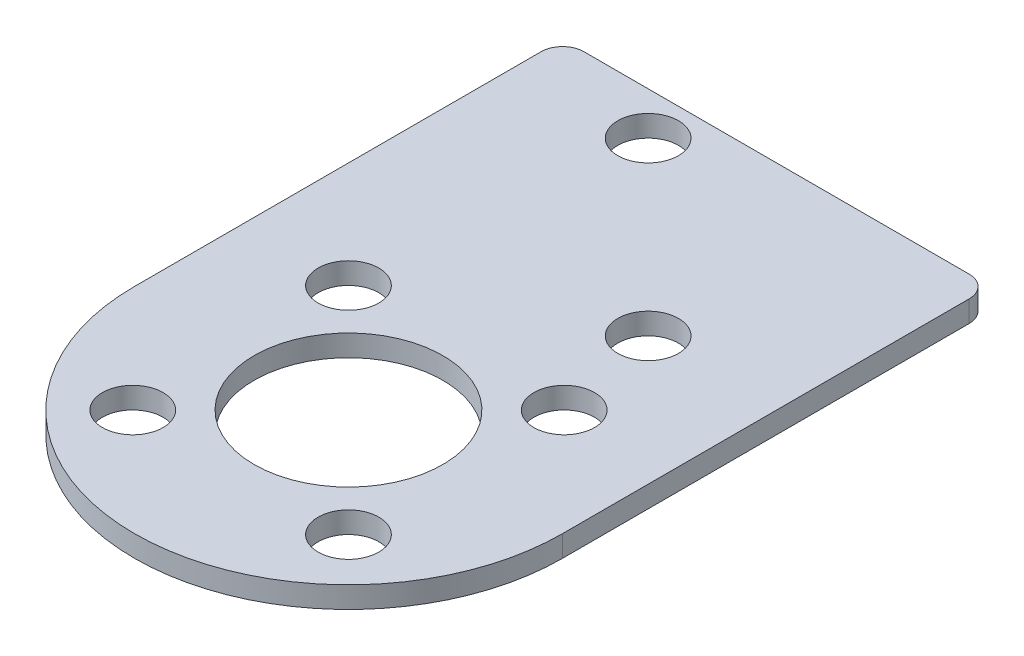
ISO-10303-21;
HEADER;
FILE_DESCRIPTION(('STEP AP214'),'2;1');
FILE_NAME('part.step','',(''),(''),'','','');
FILE_SCHEMA(('AUTOMOTIVE_DESIGN { 1 0 10303 214 1 1 1 1 }'));
ENDSEC;
DATA;
#1=APPLICATION_CONTEXT('core data for automotive mechanical design processes');
#2=APPLICATION_PROTOCOL_DEFINITION('international standard','automotive_design',2000,#1);
#3=PRODUCT_CONTEXT('',#1,'mechanical');
#4=PRODUCT('Part','Part','',(#3));
#5=PRODUCT_RELATED_PRODUCT_CATEGORY('part','',(#4));
#6=PRODUCT_DEFINITION_FORMATION('','',#4);
#7=PRODUCT_DEFINITION_CONTEXT('part definition',#1,'design');
#8=PRODUCT_DEFINITION('design','',#6,#7);
#9=PRODUCT_DEFINITION_SHAPE('','',#8);
#10=(LENGTH_UNIT() NAMED_UNIT(*) SI_UNIT(.MILLI.,.METRE.));
#11=(NAMED_UNIT(*) PLANE_ANGLE_UNIT() SI_UNIT($,.RADIAN.));
#12=(NAMED_UNIT(*) SI_UNIT($,.STERADIAN.) SOLID_ANGLE_UNIT());
#13=UNCERTAINTY_MEASURE_WITH_UNIT(LENGTH_MEASURE(1.E-05),#10,'distance_accuracy_value','');
#14=(GEOMETRIC_REPRESENTATION_CONTEXT(3) GLOBAL_UNCERTAINTY_ASSIGNED_CONTEXT((#13)) GLOBAL_UNIT_ASSIGNED_CONTEXT((#10,
#11,#12)) REPRESENTATION_CONTEXT('',''));
#15=CARTESIAN_POINT('',(0.,0.,0.));
#16=DIRECTION('',(0.,0.,1.));
#17=DIRECTION('',(1.,0.,0.));
#18=AXIS2_PLACEMENT_3D('',#15,#16,#17);
#19=CARTESIAN_POINT('',(-15.875,1.5875,0.));
#20=DIRECTION('',(-1.,0.,0.));
#21=DIRECTION('',(0.,0.,1.));
#22=AXIS2_PLACEMENT_3D('',#19,#20,#21);
#23=PLANE('',#22);
#24=DIRECTION('',(0.,0.,-1.));
#25=VECTOR('',#24,1.);
#26=CARTESIAN_POINT('',(-15.875,0.,0.));
#27=LINE('',#26,#25);
#28=CARTESIAN_POINT('',(-15.875,0.,0.));
#29=VERTEX_POINT('',#28);
#30=CARTESIAN_POINT('',(-15.875,0.,-30.1625));
#31=VERTEX_POINT('',#30);
#32=EDGE_CURVE('E145',#29,#31,#27,.T.);
#33=ORIENTED_EDGE('',*,*,#32,.F.);
#34=DIRECTION('',(0.,-1.,0.));
#35=VECTOR('',#34,1.);
#36=CARTESIAN_POINT('',(-15.875,1.5875,0.));
#37=LINE('',#36,#35);
#38=CARTESIAN_POINT('',(-15.875,1.5875,0.));
#39=VERTEX_POINT('',#38);
#40=EDGE_CURVE('E11',#39,#29,#37,.T.);
#41=ORIENTED_EDGE('',*,*,#40,.F.);
#42=DIRECTION('',(0.,0.,-1.));
#43=VECTOR('',#42,1.);
#44=CARTESIAN_POINT('',(-15.875,1.5875,0.));
#45=LINE('',#44,#43);
#46=CARTESIAN_POINT('',(-15.875,1.5875,-30.1625));
#47=VERTEX_POINT('',#46);
#48=EDGE_CURVE('E366',#39,#47,#45,.T.);
#49=ORIENTED_EDGE('',*,*,#48,.T.);
#50=DIRECTION('',(0.,-1.,0.));
#51=VECTOR('',#50,1.);
#52=CARTESIAN_POINT('',(-15.875,1.5875,-30.1625));
#53=LINE('',#52,#51);
#54=EDGE_CURVE('E58',#47,#31,#53,.T.);
#55=ORIENTED_EDGE('',*,*,#54,.T.);
#56=EDGE_LOOP('',(#33,#41,#49,#55));
#57=FACE_BOUND('',#56,.T.);
#58=ADVANCED_FACE('F41',(#57),#23,.T.);
#59=CARTESIAN_POINT('',(0.,1.5875,0.));
#60=DIRECTION('',(0.,-1.,0.));
#61=DIRECTION('',(0.,0.,-1.));
#62=AXIS2_PLACEMENT_3D('',#59,#60,#61);
#63=CYLINDRICAL_SURFACE('',#62,15.875);
#64=CARTESIAN_POINT('',(0.,0.,0.));
#65=DIRECTION('',(0.,1.,0.));
#66=DIRECTION('',(0.,0.,1.));
#67=AXIS2_PLACEMENT_3D('',#64,#65,#66);
#68=CIRCLE('',#67,15.875);
#69=CARTESIAN_POINT('',(15.875,0.,0.));
#70=VERTEX_POINT('',#69);
#71=EDGE_CURVE('E147',#29,#70,#68,.T.);
#72=ORIENTED_EDGE('',*,*,#71,.T.);
#73=DIRECTION('',(0.,-1.,0.));
#74=VECTOR('',#73,1.);
#75=CARTESIAN_POINT('',(15.875,1.5875,0.));
#76=LINE('',#75,#74);
#77=CARTESIAN_POINT('',(15.875,1.5875,0.));
#78=VERTEX_POINT('',#77);
#79=EDGE_CURVE('E50',#78,#70,#76,.T.);
#80=ORIENTED_EDGE('',*,*,#79,.F.);
#81=CARTESIAN_POINT('',(0.,1.5875,0.));
#82=DIRECTION('',(0.,1.,0.));
#83=DIRECTION('',(0.,0.,1.));
#84=AXIS2_PLACEMENT_3D('',#81,#82,#83);
#85=CIRCLE('',#84,15.875);
#86=EDGE_CURVE('E368',#39,#78,#85,.T.);
#87=ORIENTED_EDGE('',*,*,#86,.F.);
#88=ORIENTED_EDGE('',*,*,#40,.T.);
#89=EDGE_LOOP('',(#72,#80,#87,#88));
#90=FACE_BOUND('',#89,.T.);
#91=ADVANCED_FACE('F180',(#90),#63,.T.);
#92=CARTESIAN_POINT('',(15.875,1.5875,0.));
#93=DIRECTION('',(-1.,0.,0.));
#94=DIRECTION('',(0.,0.,1.));
#95=AXIS2_PLACEMENT_3D('',#92,#93,#94);
#96=PLANE('',#95);
#97=DIRECTION('',(0.,0.,-1.));
#98=VECTOR('',#97,1.);
#99=CARTESIAN_POINT('',(15.875,0.,0.));
#100=LINE('',#99,#98);
#101=CARTESIAN_POINT('',(15.875,0.,-30.1625));
#102=VERTEX_POINT('',#101);
#103=EDGE_CURVE('E150',#70,#102,#100,.T.);
#104=ORIENTED_EDGE('',*,*,#103,.T.);
#105=DIRECTION('',(0.,-1.,0.));
#106=VECTOR('',#105,1.);
#107=CARTESIAN_POINT('',(15.875,1.5875,-30.1625));
#108=LINE('',#107,#106);
#109=CARTESIAN_POINT('',(15.875,1.5875,-30.1625));
#110=VERTEX_POINT('',#109);
#111=EDGE_CURVE('E105',#110,#102,#108,.T.);
#112=ORIENTED_EDGE('',*,*,#111,.F.);
#113=DIRECTION('',(0.,0.,-1.));
#114=VECTOR('',#113,1.);
#115=CARTESIAN_POINT('',(15.875,1.5875,0.));
#116=LINE('',#115,#114);
#117=EDGE_CURVE('E115',#78,#110,#116,.T.);
#118=ORIENTED_EDGE('',*,*,#117,.F.);
#119=ORIENTED_EDGE('',*,*,#79,.T.);
#120=EDGE_LOOP('',(#104,#112,#118,#119));
#121=FACE_BOUND('',#120,.T.);
#122=ADVANCED_FACE('F177',(#121),#96,.F.);
#123=CARTESIAN_POINT('',(14.2875,1.5875,-30.1625));
#124=DIRECTION('',(0.,-1.,0.));
#125=DIRECTION('',(0.,0.,-1.));
#126=AXIS2_PLACEMENT_3D('',#123,#124,#125);
#127=CYLINDRICAL_SURFACE('',#126,1.5875);
#128=CARTESIAN_POINT('',(14.2875,0.,-30.1625));
#129=DIRECTION('',(0.,1.,0.));
#130=DIRECTION('',(0.,0.,1.));
#131=AXIS2_PLACEMENT_3D('',#128,#129,#130);
#132=CIRCLE('',#131,1.5875);
#133=CARTESIAN_POINT('',(14.2875,0.,-31.75));
#134=VERTEX_POINT('',#133);
#135=EDGE_CURVE('E101',#134,#102,#132,.F.);
#136=ORIENTED_EDGE('',*,*,#135,.F.);
#137=DIRECTION('',(0.,-1.,0.));
#138=VECTOR('',#137,1.);
#139=CARTESIAN_POINT('',(14.2875,1.5875,-31.75));
#140=LINE('',#139,#138);
#141=CARTESIAN_POINT('',(14.2875,1.5875,-31.75));
#142=VERTEX_POINT('',#141);
#143=EDGE_CURVE('E96',#142,#134,#140,.T.);
#144=ORIENTED_EDGE('',*,*,#143,.F.);
#145=CARTESIAN_POINT('',(14.2875,1.5875,-30.1625));
#146=DIRECTION('',(0.,1.,0.));
#147=DIRECTION('',(0.,0.,1.));
#148=AXIS2_PLACEMENT_3D('',#145,#146,#147);
#149=CIRCLE('',#148,1.5875);
#150=EDGE_CURVE('E99',#142,#110,#149,.F.);
#151=ORIENTED_EDGE('',*,*,#150,.T.);
#152=ORIENTED_EDGE('',*,*,#111,.T.);
#153=EDGE_LOOP('',(#136,#144,#151,#152));
#154=FACE_BOUND('',#153,.T.);
#155=ADVANCED_FACE('F98',(#154),#127,.T.);
#156=CARTESIAN_POINT('',(0.,1.5875,-31.75));
#157=DIRECTION('',(0.,0.,-1.));
#158=DIRECTION('',(-1.,0.,0.));
#159=AXIS2_PLACEMENT_3D('',#156,#157,#158);
#160=PLANE('',#159);
#161=DIRECTION('',(1.,0.,0.));
#162=VECTOR('',#161,1.);
#163=CARTESIAN_POINT('',(0.,0.,-31.75));
#164=LINE('',#163,#162);
#165=CARTESIAN_POINT('',(-14.2875,0.,-31.75));
#166=VERTEX_POINT('',#165);
#167=EDGE_CURVE('E154',#166,#134,#164,.T.);
#168=ORIENTED_EDGE('',*,*,#167,.F.);
#169=DIRECTION('',(0.,-1.,0.));
#170=VECTOR('',#169,1.);
#171=CARTESIAN_POINT('',(-14.2875,1.5875,-31.75));
#172=LINE('',#171,#170);
#173=CARTESIAN_POINT('',(-14.2875,1.5875,-31.75));
#174=VERTEX_POINT('',#173);
#175=EDGE_CURVE('E77',#174,#166,#172,.T.);
#176=ORIENTED_EDGE('',*,*,#175,.F.);
#177=DIRECTION('',(1.,0.,0.));
#178=VECTOR('',#177,1.);
#179=CARTESIAN_POINT('',(0.,1.5875,-31.75));
#180=LINE('',#179,#178);
#181=EDGE_CURVE('E113',#174,#142,#180,.T.);
#182=ORIENTED_EDGE('',*,*,#181,.T.);
#183=ORIENTED_EDGE('',*,*,#143,.T.);
#184=EDGE_LOOP('',(#168,#176,#182,#183));
#185=FACE_BOUND('',#184,.T.);
#186=ADVANCED_FACE('F118',(#185),#160,.T.);
#187=CARTESIAN_POINT('',(8.,1.5875,8.));
#188=DIRECTION('',(0.,-1.,0.));
#189=DIRECTION('',(0.,0.,-1.));
#190=AXIS2_PLACEMENT_3D('',#187,#188,#189);
#191=CYLINDRICAL_SURFACE('',#190,2.25);
#192=CARTESIAN_POINT('',(8.,1.5875,8.));
#193=DIRECTION('',(0.,1.,0.));
#194=DIRECTION('',(0.,0.,1.));
#195=AXIS2_PLACEMENT_3D('',#192,#193,#194);
#196=CIRCLE('',#195,2.25);
#197=CARTESIAN_POINT('',(8.,1.5875,10.25));
#198=VERTEX_POINT('',#197);
#199=EDGE_CURVE('E130',#198,#198,#196,.T.);
#200=ORIENTED_EDGE('',*,*,#199,.T.);
#201=EDGE_LOOP('',(#200));
#202=FACE_BOUND('',#201,.T.);
#203=CARTESIAN_POINT('',(8.,0.,8.));
#204=DIRECTION('',(0.,1.,0.));
#205=DIRECTION('',(0.,0.,1.));
#206=AXIS2_PLACEMENT_3D('',#203,#204,#205);
#207=CIRCLE('',#206,2.25);
#208=CARTESIAN_POINT('',(8.,0.,10.25));
#209=VERTEX_POINT('',#208);
#210=EDGE_CURVE('E165',#209,#209,#207,.T.);
#211=ORIENTED_EDGE('',*,*,#210,.F.);
#212=EDGE_LOOP('',(#211));
#213=FACE_BOUND('',#212,.T.);
#214=ADVANCED_FACE('F225',(#202,#213),#191,.F.);
#215=CARTESIAN_POINT('',(-8.,1.5875,-8.));
#216=DIRECTION('',(0.,-1.,0.));
#217=DIRECTION('',(0.,0.,-1.));
#218=AXIS2_PLACEMENT_3D('',#215,#216,#217);
#219=CYLINDRICAL_SURFACE('',#218,2.25);
#220=CARTESIAN_POINT('',(-8.,1.5875,-8.));
#221=DIRECTION('',(0.,1.,0.));
#222=DIRECTION('',(0.,0.,1.));
#223=AXIS2_PLACEMENT_3D('',#220,#221,#222);
#224=CIRCLE('',#223,2.25);
#225=CARTESIAN_POINT('',(-8.,1.5875,-5.75));
#226=VERTEX_POINT('',#225);
#227=EDGE_CURVE('E127',#226,#226,#224,.T.);
#228=ORIENTED_EDGE('',*,*,#227,.T.);
#229=EDGE_LOOP('',(#228));
#230=FACE_BOUND('',#229,.T.);
#231=CARTESIAN_POINT('',(-8.,0.,-8.));
#232=DIRECTION('',(0.,1.,0.));
#233=DIRECTION('',(0.,0.,1.));
#234=AXIS2_PLACEMENT_3D('',#231,#232,#233);
#235=CIRCLE('',#234,2.25);
#236=CARTESIAN_POINT('',(-8.,0.,-5.75));
#237=VERTEX_POINT('',#236);
#238=EDGE_CURVE('E162',#237,#237,#235,.T.);
#239=ORIENTED_EDGE('',*,*,#238,.F.);
#240=EDGE_LOOP('',(#239));
#241=FACE_BOUND('',#240,.T.);
#242=ADVANCED_FACE('F228',(#230,#241),#219,.F.);
#243=CARTESIAN_POINT('',(8.,1.5875,-8.));
#244=DIRECTION('',(0.,-1.,0.));
#245=DIRECTION('',(0.,0.,-1.));
#246=AXIS2_PLACEMENT_3D('',#243,#244,#245);
#247=CYLINDRICAL_SURFACE('',#246,2.25);
#248=CARTESIAN_POINT('',(8.,1.5875,-8.));
#249=DIRECTION('',(0.,1.,0.));
#250=DIRECTION('',(0.,0.,1.));
#251=AXIS2_PLACEMENT_3D('',#248,#249,#250);
#252=CIRCLE('',#251,2.25);
#253=CARTESIAN_POINT('',(8.,1.5875,-5.75));
#254=VERTEX_POINT('',#253);
#255=EDGE_CURVE('E121',#254,#254,#252,.T.);
#256=ORIENTED_EDGE('',*,*,#255,.T.);
#257=EDGE_LOOP('',(#256));
#258=FACE_BOUND('',#257,.T.);
#259=CARTESIAN_POINT('',(8.,0.,-8.));
#260=DIRECTION('',(0.,1.,0.));
#261=DIRECTION('',(0.,0.,1.));
#262=AXIS2_PLACEMENT_3D('',#259,#260,#261);
#263=CIRCLE('',#262,2.25);
#264=CARTESIAN_POINT('',(8.,0.,-5.75));
#265=VERTEX_POINT('',#264);
#266=EDGE_CURVE('E159',#265,#265,#263,.T.);
#267=ORIENTED_EDGE('',*,*,#266,.F.);
#268=EDGE_LOOP('',(#267));
#269=FACE_BOUND('',#268,.T.);
#270=ADVANCED_FACE('F232',(#258,#269),#247,.F.);
#271=CARTESIAN_POINT('',(-14.2875,1.5875,-30.1625));
#272=DIRECTION('',(0.,-1.,0.));
#273=DIRECTION('',(0.,0.,-1.));
#274=AXIS2_PLACEMENT_3D('',#271,#272,#273);
#275=CYLINDRICAL_SURFACE('',#274,1.5875);
#276=CARTESIAN_POINT('',(-14.2875,0.,-30.1625));
#277=DIRECTION('',(0.,1.,0.));
#278=DIRECTION('',(0.,0.,1.));
#279=AXIS2_PLACEMENT_3D('',#276,#277,#278);
#280=CIRCLE('',#279,1.5875);
#281=EDGE_CURVE('E156',#31,#166,#280,.F.);
#282=ORIENTED_EDGE('',*,*,#281,.F.);
#283=ORIENTED_EDGE('',*,*,#54,.F.);
#284=CARTESIAN_POINT('',(-14.2875,1.5875,-30.1625));
#285=DIRECTION('',(0.,1.,0.));
#286=DIRECTION('',(0.,0.,1.));
#287=AXIS2_PLACEMENT_3D('',#284,#285,#286);
#288=CIRCLE('',#287,1.5875);
#289=EDGE_CURVE('E119',#47,#174,#288,.F.);
#290=ORIENTED_EDGE('',*,*,#289,.T.);
#291=ORIENTED_EDGE('',*,*,#175,.T.);
#292=EDGE_LOOP('',(#282,#283,#290,#291));
#293=FACE_BOUND('',#292,.T.);
#294=ADVANCED_FACE('F195',(#293),#275,.T.);
#295=CARTESIAN_POINT('',(6.35,1.5875,-15.875));
#296=DIRECTION('',(0.,-1.,0.));
#297=DIRECTION('',(0.,0.,-1.));
#298=AXIS2_PLACEMENT_3D('',#295,#296,#297);
#299=CYLINDRICAL_SURFACE('',#298,2.25);
#300=CARTESIAN_POINT('',(6.35,1.5875,-15.875));
#301=DIRECTION('',(0.,1.,0.));
#302=DIRECTION('',(0.,0.,1.));
#303=AXIS2_PLACEMENT_3D('',#300,#301,#302);
#304=CIRCLE('',#303,2.25);
#305=CARTESIAN_POINT('',(6.35,1.5875,-13.625));
#306=VERTEX_POINT('',#305);
#307=EDGE_CURVE('E365',#306,#306,#304,.T.);
#308=ORIENTED_EDGE('',*,*,#307,.T.);
#309=EDGE_LOOP('',(#308));
#310=FACE_BOUND('',#309,.T.);
#311=CARTESIAN_POINT('',(6.35,0.,-15.875));
#312=DIRECTION('',(0.,1.,0.));
#313=DIRECTION('',(0.,0.,1.));
#314=AXIS2_PLACEMENT_3D('',#311,#312,#313);
#315=CIRCLE('',#314,2.25);
#316=CARTESIAN_POINT('',(6.35,0.,-13.625));
#317=VERTEX_POINT('',#316);
#318=EDGE_CURVE('E142',#317,#317,#315,.T.);
#319=ORIENTED_EDGE('',*,*,#318,.F.);
#320=EDGE_LOOP('',(#319));
#321=FACE_BOUND('',#320,.T.);
#322=ADVANCED_FACE('F192',(#310,#321),#299,.F.);
#323=CARTESIAN_POINT('',(-6.35,1.5875,-28.575));
#324=DIRECTION('',(0.,-1.,0.));
#325=DIRECTION('',(0.,0.,-1.));
#326=AXIS2_PLACEMENT_3D('',#323,#324,#325);
#327=CYLINDRICAL_SURFACE('',#326,2.25);
#328=CARTESIAN_POINT('',(-6.35,1.5875,-28.575));
#329=DIRECTION('',(0.,1.,0.));
#330=DIRECTION('',(0.,0.,1.));
#331=AXIS2_PLACEMENT_3D('',#328,#329,#330);
#332=CIRCLE('',#331,2.25);
#333=CARTESIAN_POINT('',(-6.35,1.5875,-26.325));
#334=VERTEX_POINT('',#333);
#335=EDGE_CURVE('E207',#334,#334,#332,.T.);
#336=ORIENTED_EDGE('',*,*,#335,.T.);
#337=EDGE_LOOP('',(#336));
#338=FACE_BOUND('',#337,.T.);
#339=CARTESIAN_POINT('',(-6.35,0.,-28.575));
#340=DIRECTION('',(0.,1.,0.));
#341=DIRECTION('',(0.,0.,1.));
#342=AXIS2_PLACEMENT_3D('',#339,#340,#341);
#343=CIRCLE('',#342,2.25);
#344=CARTESIAN_POINT('',(-6.35,0.,-26.325));
#345=VERTEX_POINT('',#344);
#346=EDGE_CURVE('E139',#345,#345,#343,.T.);
#347=ORIENTED_EDGE('',*,*,#346,.F.);
#348=EDGE_LOOP('',(#347));
#349=FACE_BOUND('',#348,.T.);
#350=ADVANCED_FACE('F194',(#338,#349),#327,.F.);
#351=CARTESIAN_POINT('',(0.,1.5875,0.));
#352=DIRECTION('',(0.,-1.,0.));
#353=DIRECTION('',(0.,0.,-1.));
#354=AXIS2_PLACEMENT_3D('',#351,#352,#353);
#355=CYLINDRICAL_SURFACE('',#354,7.);
#356=CARTESIAN_POINT('',(0.,1.5875,0.));
#357=DIRECTION('',(0.,1.,0.));
#358=DIRECTION('',(0.,0.,1.));
#359=AXIS2_PLACEMENT_3D('',#356,#357,#358);
#360=CIRCLE('',#359,7.);
#361=CARTESIAN_POINT('',(0.,1.5875,7.));
#362=VERTEX_POINT('',#361);
#363=EDGE_CURVE('E171',#362,#362,#360,.T.);
#364=ORIENTED_EDGE('',*,*,#363,.T.);
#365=EDGE_LOOP('',(#364));
#366=FACE_BOUND('',#365,.T.);
#367=CARTESIAN_POINT('',(0.,0.,0.));
#368=DIRECTION('',(0.,1.,0.));
#369=DIRECTION('',(0.,0.,1.));
#370=AXIS2_PLACEMENT_3D('',#367,#368,#369);
#371=CIRCLE('',#370,7.);
#372=CARTESIAN_POINT('',(0.,0.,7.));
#373=VERTEX_POINT('',#372);
#374=EDGE_CURVE('E136',#373,#373,#371,.T.);
#375=ORIENTED_EDGE('',*,*,#374,.F.);
#376=EDGE_LOOP('',(#375));
#377=FACE_BOUND('',#376,.T.);
#378=ADVANCED_FACE('F43',(#366,#377),#355,.F.);
#379=CARTESIAN_POINT('',(-8.,1.5875,8.));
#380=DIRECTION('',(0.,-1.,0.));
#381=DIRECTION('',(0.,0.,-1.));
#382=AXIS2_PLACEMENT_3D('',#379,#380,#381);
#383=CYLINDRICAL_SURFACE('',#382,2.25);
#384=CARTESIAN_POINT('',(-8.,1.5875,8.));
#385=DIRECTION('',(0.,1.,0.));
#386=DIRECTION('',(0.,0.,1.));
#387=AXIS2_PLACEMENT_3D('',#384,#385,#386);
#388=CIRCLE('',#387,2.25);
#389=CARTESIAN_POINT('',(-8.,1.5875,10.25));
#390=VERTEX_POINT('',#389);
#391=EDGE_CURVE('E133',#390,#390,#388,.T.);
#392=ORIENTED_EDGE('',*,*,#391,.T.);
#393=EDGE_LOOP('',(#392));
#394=FACE_BOUND('',#393,.T.);
#395=CARTESIAN_POINT('',(-8.,0.,8.));
#396=DIRECTION('',(0.,1.,0.));
#397=DIRECTION('',(0.,0.,1.));
#398=AXIS2_PLACEMENT_3D('',#395,#396,#397);
#399=CIRCLE('',#398,2.25);
#400=CARTESIAN_POINT('',(-8.,0.,10.25));
#401=VERTEX_POINT('',#400);
#402=EDGE_CURVE('E168',#401,#401,#399,.T.);
#403=ORIENTED_EDGE('',*,*,#402,.F.);
#404=EDGE_LOOP('',(#403));
#405=FACE_BOUND('',#404,.T.);
#406=ADVANCED_FACE('F202',(#394,#405),#383,.F.);
#407=CARTESIAN_POINT('',(0.,1.5875,0.));
#408=DIRECTION('',(0.,1.,0.));
#409=DIRECTION('',(0.,0.,1.));
#410=AXIS2_PLACEMENT_3D('',#407,#408,#409);
#411=PLANE('',#410);
#412=ORIENTED_EDGE('',*,*,#363,.F.);
#413=EDGE_LOOP('',(#412));
#414=FACE_BOUND('',#413,.T.);
#415=ORIENTED_EDGE('',*,*,#335,.F.);
#416=EDGE_LOOP('',(#415));
#417=FACE_BOUND('',#416,.T.);
#418=ORIENTED_EDGE('',*,*,#307,.F.);
#419=EDGE_LOOP('',(#418));
#420=FACE_BOUND('',#419,.T.);
#421=ORIENTED_EDGE('',*,*,#48,.F.);
#422=ORIENTED_EDGE('',*,*,#86,.T.);
#423=ORIENTED_EDGE('',*,*,#117,.T.);
#424=ORIENTED_EDGE('',*,*,#150,.F.);
#425=ORIENTED_EDGE('',*,*,#181,.F.);
#426=ORIENTED_EDGE('',*,*,#289,.F.);
#427=EDGE_LOOP('',(#421,#422,#423,#424,#425,#426));
#428=FACE_BOUND('',#427,.T.);
#429=ORIENTED_EDGE('',*,*,#255,.F.);
#430=EDGE_LOOP('',(#429));
#431=FACE_BOUND('',#430,.T.);
#432=ORIENTED_EDGE('',*,*,#227,.F.);
#433=EDGE_LOOP('',(#432));
#434=FACE_BOUND('',#433,.T.);
#435=ORIENTED_EDGE('',*,*,#199,.F.);
#436=EDGE_LOOP('',(#435));
#437=FACE_BOUND('',#436,.T.);
#438=ORIENTED_EDGE('',*,*,#391,.F.);
#439=EDGE_LOOP('',(#438));
#440=FACE_BOUND('',#439,.T.);
#441=ADVANCED_FACE('F110',(#414,#417,#420,#428,#431,#434,#437,#440),#411,.T.);
#442=CARTESIAN_POINT('',(0.,0.,0.));
#443=DIRECTION('',(0.,1.,0.));
#444=DIRECTION('',(0.,0.,1.));
#445=AXIS2_PLACEMENT_3D('',#442,#443,#444);
#446=PLANE('',#445);
#447=ORIENTED_EDGE('',*,*,#374,.T.);
#448=EDGE_LOOP('',(#447));
#449=FACE_BOUND('',#448,.T.);
#450=ORIENTED_EDGE('',*,*,#346,.T.);
#451=EDGE_LOOP('',(#450));
#452=FACE_BOUND('',#451,.T.);
#453=ORIENTED_EDGE('',*,*,#318,.T.);
#454=EDGE_LOOP('',(#453));
#455=FACE_BOUND('',#454,.T.);
#456=ORIENTED_EDGE('',*,*,#32,.T.);
#457=ORIENTED_EDGE('',*,*,#281,.T.);
#458=ORIENTED_EDGE('',*,*,#167,.T.);
#459=ORIENTED_EDGE('',*,*,#135,.T.);
#460=ORIENTED_EDGE('',*,*,#103,.F.);
#461=ORIENTED_EDGE('',*,*,#71,.F.);
#462=EDGE_LOOP('',(#456,#457,#458,#459,#460,#461));
#463=FACE_BOUND('',#462,.T.);
#464=ORIENTED_EDGE('',*,*,#266,.T.);
#465=EDGE_LOOP('',(#464));
#466=FACE_BOUND('',#465,.T.);
#467=ORIENTED_EDGE('',*,*,#238,.T.);
#468=EDGE_LOOP('',(#467));
#469=FACE_BOUND('',#468,.T.);
#470=ORIENTED_EDGE('',*,*,#210,.T.);
#471=EDGE_LOOP('',(#470));
#472=FACE_BOUND('',#471,.T.);
#473=ORIENTED_EDGE('',*,*,#402,.T.);
#474=EDGE_LOOP('',(#473));
#475=FACE_BOUND('',#474,.T.);
#476=ADVANCED_FACE('F182',(#449,#452,#455,#463,#466,#469,#472,#475),#446,.F.);
#477=CLOSED_SHELL('',(#58,#91,#122,#155,#186,#214,#242,#270,#294,#322,#350,#378,#406,#441,#476));
#478=MANIFOLD_SOLID_BREP('B2',#477);
#479=ADVANCED_BREP_SHAPE_REPRESENTATION('',(#18,#478),#14);
#480=SHAPE_DEFINITION_REPRESENTATION(#9,#479);
ENDSEC;
END-ISO-10303-21;
